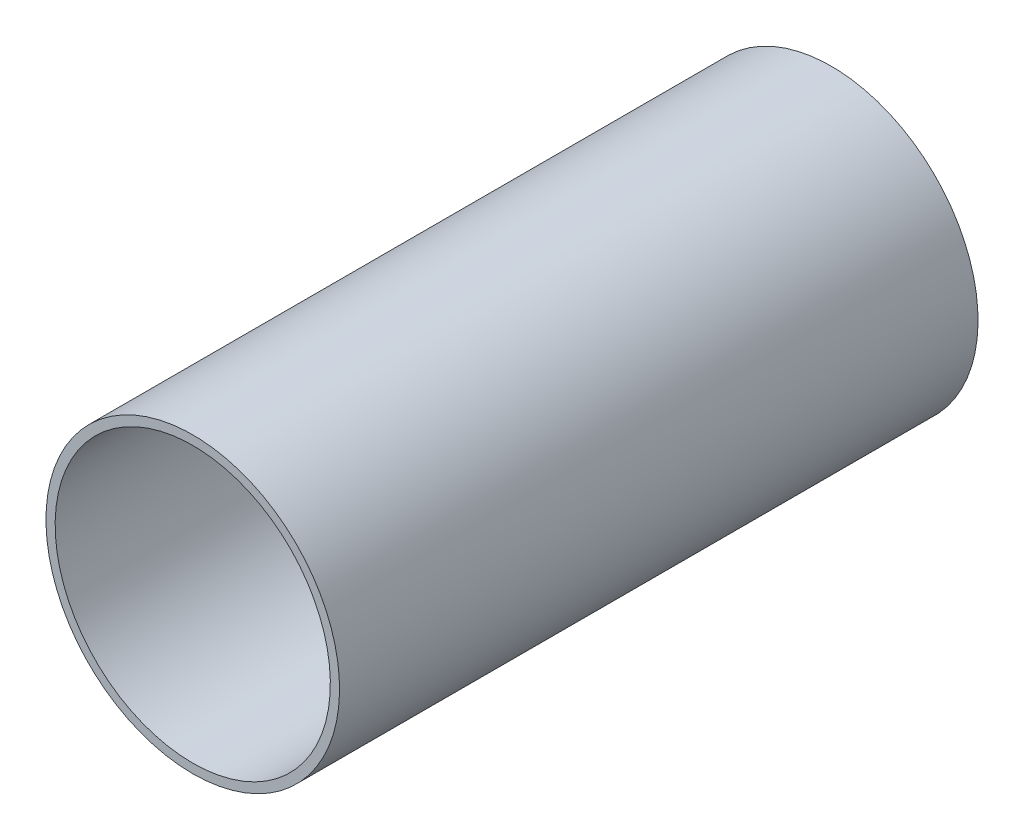
ISO-10303-21;
HEADER;
FILE_DESCRIPTION(('STEP AP214'),'2;1');
FILE_NAME('part.step','',(''),(''),'','','');
FILE_SCHEMA(('AUTOMOTIVE_DESIGN { 1 0 10303 214 1 1 1 1 }'));
ENDSEC;
DATA;
#1=APPLICATION_CONTEXT('core data for automotive mechanical design processes');
#2=APPLICATION_PROTOCOL_DEFINITION('international standard','automotive_design',2000,#1);
#3=PRODUCT_CONTEXT('',#1,'mechanical');
#4=PRODUCT('Part','Part','',(#3));
#5=PRODUCT_RELATED_PRODUCT_CATEGORY('part','',(#4));
#6=PRODUCT_DEFINITION_FORMATION('','',#4);
#7=PRODUCT_DEFINITION_CONTEXT('part definition',#1,'design');
#8=PRODUCT_DEFINITION('design','',#6,#7);
#9=PRODUCT_DEFINITION_SHAPE('','',#8);
#10=(LENGTH_UNIT() NAMED_UNIT(*) SI_UNIT(.MILLI.,.METRE.));
#11=(NAMED_UNIT(*) PLANE_ANGLE_UNIT() SI_UNIT($,.RADIAN.));
#12=(NAMED_UNIT(*) SI_UNIT($,.STERADIAN.) SOLID_ANGLE_UNIT());
#13=UNCERTAINTY_MEASURE_WITH_UNIT(LENGTH_MEASURE(1.E-05),#10,'distance_accuracy_value','');
#14=(GEOMETRIC_REPRESENTATION_CONTEXT(3) GLOBAL_UNCERTAINTY_ASSIGNED_CONTEXT((#13)) GLOBAL_UNIT_ASSIGNED_CONTEXT((#10,
#11,#12)) REPRESENTATION_CONTEXT('',''));
#15=CARTESIAN_POINT('',(0.,0.,0.));
#16=DIRECTION('',(0.,0.,1.));
#17=DIRECTION('',(1.,0.,0.));
#18=AXIS2_PLACEMENT_3D('',#15,#16,#17);
#19=CARTESIAN_POINT('',(147.32,-103.632,-0.045));
#20=DIRECTION('',(0.,0.,-1.));
#21=DIRECTION('',(0.,-1.,0.));
#22=AXIS2_PLACEMENT_3D('',#19,#20,#21);
#23=CYLINDRICAL_SURFACE('',#22,0.375);
#24=CARTESIAN_POINT('',(147.32,-103.632,-0.035));
#25=DIRECTION('',(0.,0.,-1.));
#26=DIRECTION('',(0.,-1.,0.));
#27=AXIS2_PLACEMENT_3D('',#24,#25,#26);
#28=CIRCLE('',#27,0.375);
#29=CARTESIAN_POINT('',(147.32,-104.007,-0.035));
#30=VERTEX_POINT('',#29);
#31=EDGE_CURVE('E64',#30,#30,#28,.T.);
#32=ORIENTED_EDGE('',*,*,#31,.T.);
#33=DIRECTION('',(0.,0.,1.));
#34=VECTOR('',#33,1.);
#35=CARTESIAN_POINT('',(147.32,-104.007,-0.045));
#36=LINE('',#35,#34);
#37=CARTESIAN_POINT('',(147.32,-104.007,1.705));
#38=VERTEX_POINT('',#37);
#39=EDGE_CURVE('E11',#30,#38,#36,.T.);
#40=ORIENTED_EDGE('',*,*,#39,.T.);
#41=CARTESIAN_POINT('',(147.32,-103.632,1.705));
#42=DIRECTION('',(0.,0.,-1.));
#43=DIRECTION('',(0.,-1.,0.));
#44=AXIS2_PLACEMENT_3D('',#41,#42,#43);
#45=CIRCLE('',#44,0.375);
#46=EDGE_CURVE('E25',#38,#38,#45,.T.);
#47=ORIENTED_EDGE('',*,*,#46,.F.);
#48=ORIENTED_EDGE('',*,*,#39,.F.);
#49=EDGE_LOOP('',(#32,#40,#47,#48));
#50=FACE_BOUND('',#49,.T.);
#51=ADVANCED_FACE('F17',(#50),#23,.F.);
#52=CARTESIAN_POINT('',(147.32,-104.032,1.705));
#53=DIRECTION('',(0.,0.,1.));
#54=DIRECTION('',(1.,0.,0.));
#55=AXIS2_PLACEMENT_3D('',#52,#53,#54);
#56=PLANE('',#55);
#57=ORIENTED_EDGE('',*,*,#46,.T.);
#58=EDGE_LOOP('',(#57));
#59=FACE_BOUND('',#58,.T.);
#60=CARTESIAN_POINT('',(147.32,-103.632,1.705));
#61=DIRECTION('',(0.,0.,1.));
#62=DIRECTION('',(0.,-1.,0.));
#63=AXIS2_PLACEMENT_3D('',#60,#61,#62);
#64=CIRCLE('',#63,0.4);
#65=CARTESIAN_POINT('',(147.32,-104.032,1.705));
#66=VERTEX_POINT('',#65);
#67=EDGE_CURVE('E56',#66,#66,#64,.T.);
#68=ORIENTED_EDGE('',*,*,#67,.T.);
#69=EDGE_LOOP('',(#68));
#70=FACE_BOUND('',#69,.T.);
#71=ADVANCED_FACE('F76',(#59,#70),#56,.T.);
#72=CARTESIAN_POINT('',(147.32,-104.032,-0.035));
#73=DIRECTION('',(0.,0.,1.));
#74=DIRECTION('',(1.,0.,0.));
#75=AXIS2_PLACEMENT_3D('',#72,#73,#74);
#76=PLANE('',#75);
#77=ORIENTED_EDGE('',*,*,#31,.F.);
#78=EDGE_LOOP('',(#77));
#79=FACE_BOUND('',#78,.T.);
#80=CARTESIAN_POINT('',(147.32,-103.632,-0.035));
#81=DIRECTION('',(0.,0.,1.));
#82=DIRECTION('',(0.,-1.,0.));
#83=AXIS2_PLACEMENT_3D('',#80,#81,#82);
#84=CIRCLE('',#83,0.4);
#85=CARTESIAN_POINT('',(147.32,-104.032,-0.035));
#86=VERTEX_POINT('',#85);
#87=EDGE_CURVE('E55',#86,#86,#84,.T.);
#88=ORIENTED_EDGE('',*,*,#87,.F.);
#89=EDGE_LOOP('',(#88));
#90=FACE_BOUND('',#89,.T.);
#91=ADVANCED_FACE('F84',(#79,#90),#76,.F.);
#92=CARTESIAN_POINT('',(147.32,-103.632,-0.035));
#93=DIRECTION('',(0.,0.,-1.));
#94=DIRECTION('',(0.,-1.,0.));
#95=AXIS2_PLACEMENT_3D('',#92,#93,#94);
#96=CYLINDRICAL_SURFACE('',#95,0.4);
#97=ORIENTED_EDGE('',*,*,#87,.T.);
#98=DIRECTION('',(0.,0.,1.));
#99=VECTOR('',#98,1.);
#100=CARTESIAN_POINT('',(147.32,-104.032,-0.035));
#101=LINE('',#100,#99);
#102=EDGE_CURVE('E52',#86,#66,#101,.T.);
#103=ORIENTED_EDGE('',*,*,#102,.T.);
#104=ORIENTED_EDGE('',*,*,#67,.F.);
#105=ORIENTED_EDGE('',*,*,#102,.F.);
#106=EDGE_LOOP('',(#97,#103,#104,#105));
#107=FACE_BOUND('',#106,.T.);
#108=ADVANCED_FACE('F53',(#107),#96,.T.);
#109=CLOSED_SHELL('',(#51,#71,#91,#108));
#110=MANIFOLD_SOLID_BREP('B1',#109);
#111=ADVANCED_BREP_SHAPE_REPRESENTATION('',(#18,#110),#14);
#112=SHAPE_DEFINITION_REPRESENTATION(#9,#111);
ENDSEC;
END-ISO-10303-21;
